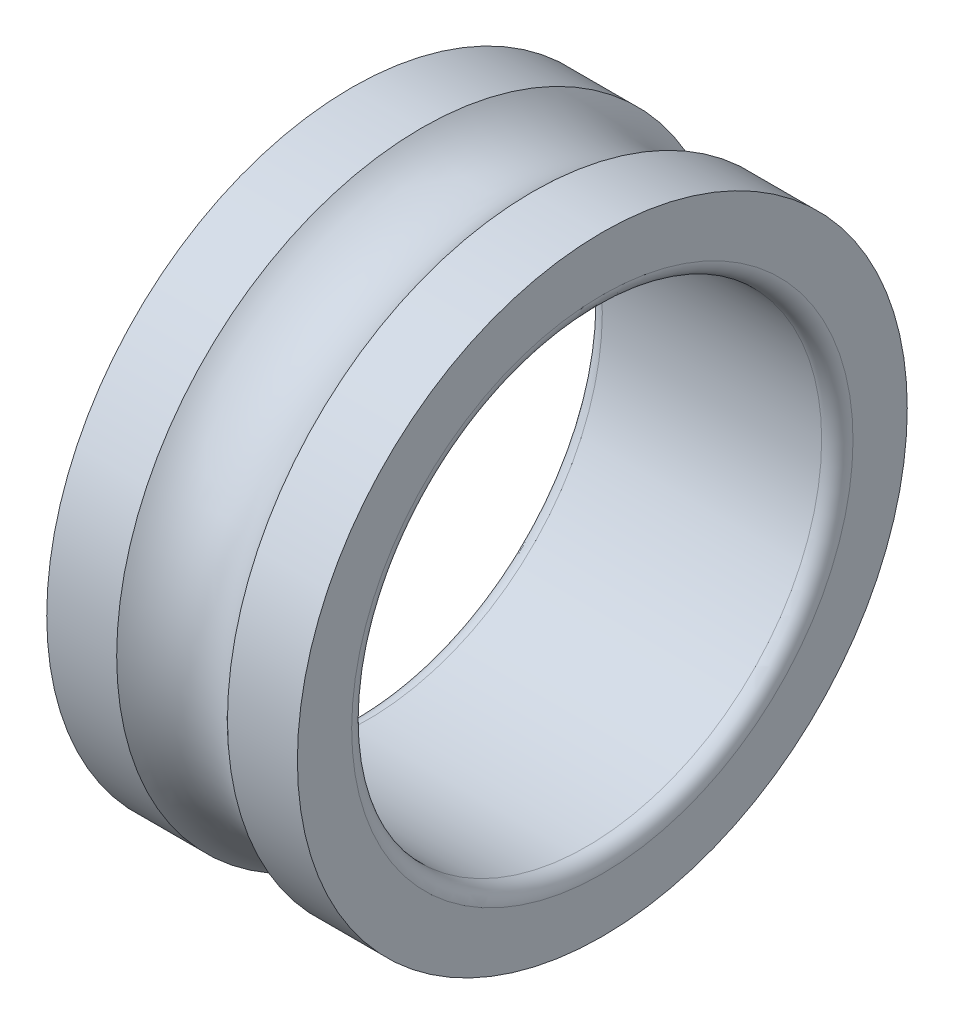
ISO-10303-21;
HEADER;
FILE_DESCRIPTION(('STEP AP214'),'2;1');
FILE_NAME('part.step','',(''),(''),'','','');
FILE_SCHEMA(('AUTOMOTIVE_DESIGN { 1 0 10303 214 1 1 1 1 }'));
ENDSEC;
DATA;
#1=APPLICATION_CONTEXT('core data for automotive mechanical design processes');
#2=APPLICATION_PROTOCOL_DEFINITION('international standard','automotive_design',2000,#1);
#3=PRODUCT_CONTEXT('',#1,'mechanical');
#4=PRODUCT('Part','Part','',(#3));
#5=PRODUCT_RELATED_PRODUCT_CATEGORY('part','',(#4));
#6=PRODUCT_DEFINITION_FORMATION('','',#4);
#7=PRODUCT_DEFINITION_CONTEXT('part definition',#1,'design');
#8=PRODUCT_DEFINITION('design','',#6,#7);
#9=PRODUCT_DEFINITION_SHAPE('','',#8);
#10=(LENGTH_UNIT() NAMED_UNIT(*) SI_UNIT(.MILLI.,.METRE.));
#11=(NAMED_UNIT(*) PLANE_ANGLE_UNIT() SI_UNIT($,.RADIAN.));
#12=(NAMED_UNIT(*) SI_UNIT($,.STERADIAN.) SOLID_ANGLE_UNIT());
#13=UNCERTAINTY_MEASURE_WITH_UNIT(LENGTH_MEASURE(1.E-05),#10,'distance_accuracy_value','');
#14=(GEOMETRIC_REPRESENTATION_CONTEXT(3) GLOBAL_UNCERTAINTY_ASSIGNED_CONTEXT((#13)) GLOBAL_UNIT_ASSIGNED_CONTEXT((#10,
#11,#12)) REPRESENTATION_CONTEXT('',''));
#15=CARTESIAN_POINT('',(0.,0.,0.));
#16=DIRECTION('',(0.,0.,1.));
#17=DIRECTION('',(1.,0.,0.));
#18=AXIS2_PLACEMENT_3D('',#15,#16,#17);
#19=CARTESIAN_POINT('',(72.9943089574791,0.,0.));
#20=DIRECTION('',(-1.,0.,0.));
#21=DIRECTION('',(0.,0.877582561890372,-0.479425538604204));
#22=AXIS2_PLACEMENT_3D('',#19,#20,#21);
#23=TOROIDAL_SURFACE('',#22,23.,5.);
#24=CARTESIAN_POINT('',(69.4587750515691,0.,0.));
#25=DIRECTION('',(1.,0.,0.));
#26=DIRECTION('',(0.,0.,-1.));
#27=AXIS2_PLACEMENT_3D('',#24,#25,#26);
#28=CIRCLE('',#27,19.4644660941);
#29=CARTESIAN_POINT('',(69.4587750515691,0.,-19.4644660941));
#30=VERTEX_POINT('',#29);
#31=EDGE_CURVE('E258',#30,#30,#28,.F.);
#32=ORIENTED_EDGE('',*,*,#31,.F.);
#33=EDGE_LOOP('',(#32));
#34=FACE_BOUND('',#33,.T.);
#35=CARTESIAN_POINT('',(76.5298428634091,0.,0.));
#36=DIRECTION('',(1.,0.,0.));
#37=DIRECTION('',(0.,0.,-1.));
#38=AXIS2_PLACEMENT_3D('',#35,#36,#37);
#39=CIRCLE('',#38,19.4644660941);
#40=CARTESIAN_POINT('',(76.5298428634091,0.,-19.4644660941));
#41=VERTEX_POINT('',#40);
#42=EDGE_CURVE('E255',#41,#41,#39,.T.);
#43=ORIENTED_EDGE('',*,*,#42,.F.);
#44=EDGE_LOOP('',(#43));
#45=FACE_BOUND('',#44,.T.);
#46=ADVANCED_FACE('F17',(#34,#45),#23,.F.);
#47=CARTESIAN_POINT('',(72.9943089573691,0.,0.));
#48=DIRECTION('',(1.,0.,0.));
#49=DIRECTION('',(0.,0.,-1.));
#50=AXIS2_PLACEMENT_3D('',#47,#48,#49);
#51=CYLINDRICAL_SURFACE('',#50,19.4644660941);
#52=CARTESIAN_POINT('',(64.9943089574691,0.,0.));
#53=DIRECTION('',(1.,0.,0.));
#54=DIRECTION('',(0.,0.,-1.));
#55=AXIS2_PLACEMENT_3D('',#52,#53,#54);
#56=CIRCLE('',#55,19.4644660941);
#57=CARTESIAN_POINT('',(64.9943089574691,0.,-19.4644660941));
#58=VERTEX_POINT('',#57);
#59=EDGE_CURVE('E252',#58,#58,#56,.F.);
#60=ORIENTED_EDGE('',*,*,#59,.F.);
#61=EDGE_LOOP('',(#60));
#62=FACE_BOUND('',#61,.T.);
#63=ORIENTED_EDGE('',*,*,#31,.T.);
#64=EDGE_LOOP('',(#63));
#65=FACE_BOUND('',#64,.T.);
#66=ADVANCED_FACE('F130',(#62,#65),#51,.T.);
#67=CARTESIAN_POINT('',(72.9943089573691,0.,0.));
#68=DIRECTION('',(1.,0.,0.));
#69=DIRECTION('',(0.,0.,-1.));
#70=AXIS2_PLACEMENT_3D('',#67,#68,#69);
#71=CYLINDRICAL_SURFACE('',#70,19.4644660941);
#72=ORIENTED_EDGE('',*,*,#42,.T.);
#73=EDGE_LOOP('',(#72));
#74=FACE_BOUND('',#73,.T.);
#75=CARTESIAN_POINT('',(80.9943089574791,0.,0.));
#76=DIRECTION('',(1.,0.,0.));
#77=DIRECTION('',(0.,0.,-1.));
#78=AXIS2_PLACEMENT_3D('',#75,#76,#77);
#79=CIRCLE('',#78,19.4644660941);
#80=CARTESIAN_POINT('',(80.9943089574791,0.,-19.4644660941));
#81=VERTEX_POINT('',#80);
#82=EDGE_CURVE('E250',#81,#81,#79,.F.);
#83=ORIENTED_EDGE('',*,*,#82,.T.);
#84=EDGE_LOOP('',(#83));
#85=FACE_BOUND('',#84,.T.);
#86=ADVANCED_FACE('F127',(#74,#85),#71,.T.);
#87=CARTESIAN_POINT('',(64.9943089574691,30.,0.));
#88=DIRECTION('',(-1.,0.,0.));
#89=DIRECTION('',(0.,0.,1.));
#90=AXIS2_PLACEMENT_3D('',#87,#88,#89);
#91=PLANE('',#90);
#92=CARTESIAN_POINT('',(64.9943089574691,0.,0.));
#93=DIRECTION('',(-1.,0.,0.));
#94=DIRECTION('',(0.,-0.877582561891139,0.479425538602801));
#95=AXIS2_PLACEMENT_3D('',#92,#93,#94);
#96=CIRCLE('',#95,16.0000000000244);
#97=CARTESIAN_POINT('',(64.9943089574691,-14.0413209902833,7.67080861765993));
#98=VERTEX_POINT('',#97);
#99=CARTESIAN_POINT('',(64.9943089574691,14.0413209902545,-7.67080861767194));
#100=VERTEX_POINT('',#99);
#101=EDGE_CURVE('E53',#98,#100,#96,.T.);
#102=ORIENTED_EDGE('',*,*,#101,.F.);
#103=CARTESIAN_POINT('',(64.9943089574691,0.,0.));
#104=DIRECTION('',(-1.,0.,0.));
#105=DIRECTION('',(0.,0.877582561890372,-0.479425538604204));
#106=AXIS2_PLACEMENT_3D('',#103,#104,#105);
#107=CIRCLE('',#106,16.);
#108=EDGE_CURVE('E48',#100,#98,#107,.T.);
#109=ORIENTED_EDGE('',*,*,#108,.F.);
#110=EDGE_LOOP('',(#102,#109));
#111=FACE_BOUND('',#110,.T.);
#112=ORIENTED_EDGE('',*,*,#59,.T.);
#113=EDGE_LOOP('',(#112));
#114=FACE_BOUND('',#113,.T.);
#115=ADVANCED_FACE('F51',(#111,#114),#91,.T.);
#116=CARTESIAN_POINT('',(80.9943089574791,26.5355339059,0.));
#117=DIRECTION('',(-1.,0.,0.));
#118=DIRECTION('',(0.,0.,1.));
#119=AXIS2_PLACEMENT_3D('',#116,#117,#118);
#120=PLANE('',#119);
#121=CARTESIAN_POINT('',(80.9943089574791,0.,0.));
#122=DIRECTION('',(1.,0.,0.));
#123=DIRECTION('',(0.,0.877582561890372,-0.479425538604204));
#124=AXIS2_PLACEMENT_3D('',#121,#122,#123);
#125=CIRCLE('',#124,15.9999999999805);
#126=CARTESIAN_POINT('',(80.9943089574791,14.0413209902207,-7.67080861766462));
#127=VERTEX_POINT('',#126);
#128=CARTESIAN_POINT('',(80.9943089574791,-14.0413209902431,7.67080861766027));
#129=VERTEX_POINT('',#128);
#130=EDGE_CURVE('E35',#127,#129,#125,.T.);
#131=ORIENTED_EDGE('',*,*,#130,.F.);
#132=CARTESIAN_POINT('',(80.9943089574791,0.,0.));
#133=DIRECTION('',(1.,0.,0.));
#134=DIRECTION('',(0.,-0.877582561890729,0.47942553860355));
#135=AXIS2_PLACEMENT_3D('',#132,#133,#134);
#136=CIRCLE('',#135,16.);
#137=EDGE_CURVE('E39',#129,#127,#136,.T.);
#138=ORIENTED_EDGE('',*,*,#137,.F.);
#139=EDGE_LOOP('',(#131,#138));
#140=FACE_BOUND('',#139,.T.);
#141=ORIENTED_EDGE('',*,*,#82,.F.);
#142=EDGE_LOOP('',(#141));
#143=FACE_BOUND('',#142,.T.);
#144=ADVANCED_FACE('F79',(#140,#143),#120,.F.);
#145=CARTESIAN_POINT('',(65.9943089574691,0.,0.));
#146=DIRECTION('',(-1.,0.,0.));
#147=DIRECTION('',(0.,0.877582561890372,-0.479425538604204));
#148=AXIS2_PLACEMENT_3D('',#145,#146,#147);
#149=TOROIDAL_SURFACE('',#148,16.,1.);
#150=CARTESIAN_POINT('',(65.9943100751691,0.,0.));
#151=DIRECTION('',(1.,0.,0.));
#152=DIRECTION('',(0.,0.,-1.));
#153=AXIS2_PLACEMENT_3D('',#150,#151,#152);
#154=CIRCLE('',#153,15.0000011177);
#155=CARTESIAN_POINT('',(65.9943100751691,0.,-15.0000011177));
#156=VERTEX_POINT('',#155);
#157=EDGE_CURVE('E28',#156,#156,#154,.T.);
#158=ORIENTED_EDGE('',*,*,#157,.T.);
#159=EDGE_LOOP('',(#158));
#160=FACE_BOUND('',#159,.T.);
#161=ORIENTED_EDGE('',*,*,#101,.T.);
#162=ORIENTED_EDGE('',*,*,#108,.T.);
#163=EDGE_LOOP('',(#161,#162));
#164=FACE_BOUND('',#163,.T.);
#165=ADVANCED_FACE('F59',(#160,#164),#149,.T.);
#166=CARTESIAN_POINT('',(79.9943089574791,0.,0.));
#167=DIRECTION('',(-1.,0.,0.));
#168=DIRECTION('',(0.,0.877582561890372,-0.479425538604204));
#169=AXIS2_PLACEMENT_3D('',#166,#167,#168);
#170=TOROIDAL_SURFACE('',#169,16.,1.);
#171=ORIENTED_EDGE('',*,*,#137,.T.);
#172=ORIENTED_EDGE('',*,*,#130,.T.);
#173=EDGE_LOOP('',(#171,#172));
#174=FACE_BOUND('',#173,.T.);
#175=CARTESIAN_POINT('',(79.9943100751891,0.,0.));
#176=DIRECTION('',(1.,0.,0.));
#177=DIRECTION('',(0.,0.,-1.));
#178=AXIS2_PLACEMENT_3D('',#175,#176,#177);
#179=CIRCLE('',#178,15.0000011177);
#180=CARTESIAN_POINT('',(79.9943100751891,0.,-15.0000011177));
#181=VERTEX_POINT('',#180);
#182=EDGE_CURVE('E11',#181,#181,#179,.F.);
#183=ORIENTED_EDGE('',*,*,#182,.T.);
#184=EDGE_LOOP('',(#183));
#185=FACE_BOUND('',#184,.T.);
#186=ADVANCED_FACE('F78',(#174,#185),#170,.T.);
#187=CARTESIAN_POINT('',(72.9943089573691,0.,0.));
#188=DIRECTION('',(1.,0.,0.));
#189=DIRECTION('',(0.,0.,-1.));
#190=AXIS2_PLACEMENT_3D('',#187,#188,#189);
#191=CYLINDRICAL_SURFACE('',#190,15.0000011177);
#192=ORIENTED_EDGE('',*,*,#182,.F.);
#193=EDGE_LOOP('',(#192));
#194=FACE_BOUND('',#193,.T.);
#195=ORIENTED_EDGE('',*,*,#157,.F.);
#196=EDGE_LOOP('',(#195));
#197=FACE_BOUND('',#196,.T.);
#198=ADVANCED_FACE('F141',(#194,#197),#191,.F.);
#199=CLOSED_SHELL('',(#46,#66,#86,#115,#144,#165,#186,#198));
#200=MANIFOLD_SOLID_BREP('B1',#199);
#201=ADVANCED_BREP_SHAPE_REPRESENTATION('',(#18,#200),#14);
#202=SHAPE_DEFINITION_REPRESENTATION(#9,#201);
ENDSEC;
END-ISO-10303-21;
